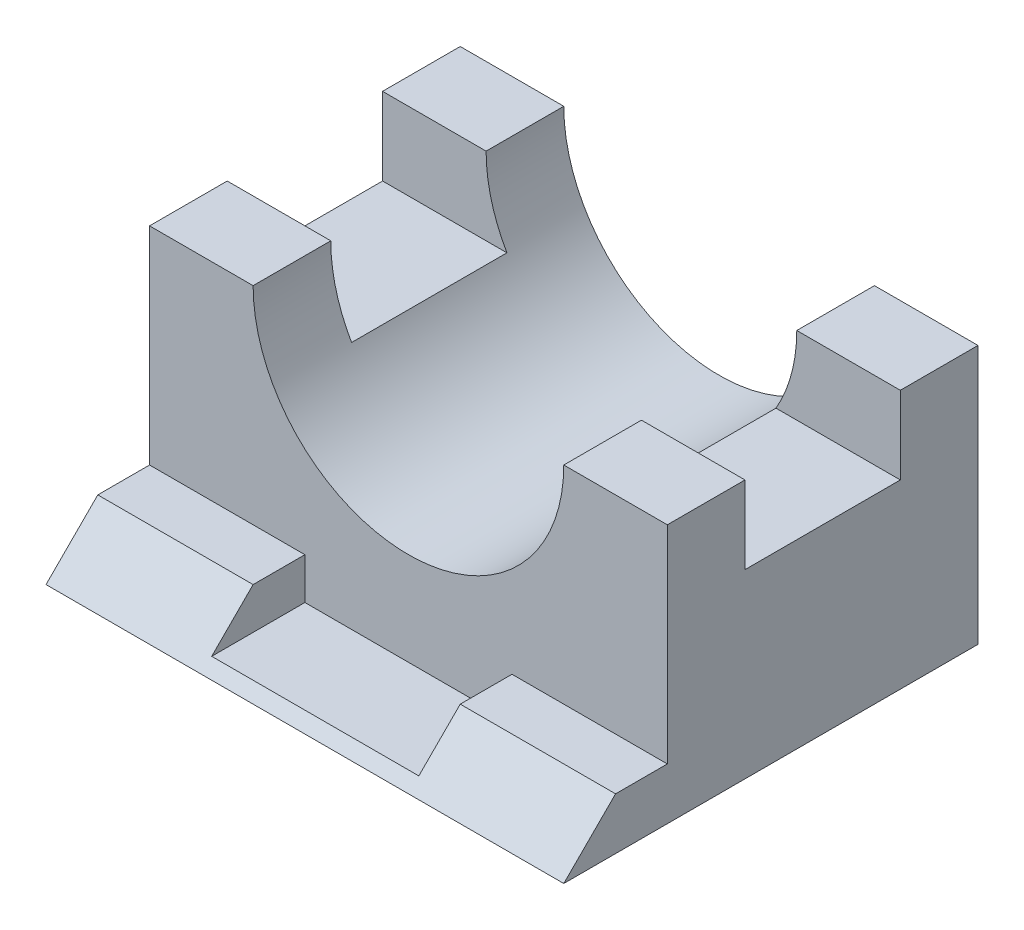
ISO-10303-21;
HEADER;
FILE_DESCRIPTION(('STEP AP214'),'2;1');
FILE_NAME('part.step','',(''),(''),'','','');
FILE_SCHEMA(('AUTOMOTIVE_DESIGN { 1 0 10303 214 1 1 1 1 }'));
ENDSEC;
DATA;
#1=APPLICATION_CONTEXT('core data for automotive mechanical design processes');
#2=APPLICATION_PROTOCOL_DEFINITION('international standard','automotive_design',2000,#1);
#3=PRODUCT_CONTEXT('',#1,'mechanical');
#4=PRODUCT('Part','Part','',(#3));
#5=PRODUCT_RELATED_PRODUCT_CATEGORY('part','',(#4));
#6=PRODUCT_DEFINITION_FORMATION('','',#4);
#7=PRODUCT_DEFINITION_CONTEXT('part definition',#1,'design');
#8=PRODUCT_DEFINITION('design','',#6,#7);
#9=PRODUCT_DEFINITION_SHAPE('','',#8);
#10=(LENGTH_UNIT() NAMED_UNIT(*) SI_UNIT(.MILLI.,.METRE.));
#11=(NAMED_UNIT(*) PLANE_ANGLE_UNIT() SI_UNIT($,.RADIAN.));
#12=(NAMED_UNIT(*) SI_UNIT($,.STERADIAN.) SOLID_ANGLE_UNIT());
#13=UNCERTAINTY_MEASURE_WITH_UNIT(LENGTH_MEASURE(1.E-05),#10,'distance_accuracy_value','');
#14=(GEOMETRIC_REPRESENTATION_CONTEXT(3) GLOBAL_UNCERTAINTY_ASSIGNED_CONTEXT((#13)) GLOBAL_UNIT_ASSIGNED_CONTEXT((#10,
#11,#12)) REPRESENTATION_CONTEXT('',''));
#15=CARTESIAN_POINT('',(0.,0.,0.));
#16=DIRECTION('',(0.,0.,1.));
#17=DIRECTION('',(1.,0.,0.));
#18=AXIS2_PLACEMENT_3D('',#15,#16,#17);
#19=CARTESIAN_POINT('',(50.,10.,20.));
#20=DIRECTION('',(0.,-1.,0.));
#21=DIRECTION('',(0.,0.,-1.));
#22=AXIS2_PLACEMENT_3D('',#19,#20,#21);
#23=PLANE('',#22);
#24=DIRECTION('',(0.,0.,-1.));
#25=VECTOR('',#24,1.);
#26=CARTESIAN_POINT('',(-20.,10.,120.));
#27=LINE('',#26,#25);
#28=CARTESIAN_POINT('',(-20.,10.,30.));
#29=VERTEX_POINT('',#28);
#30=CARTESIAN_POINT('',(-20.,10.,20.));
#31=VERTEX_POINT('',#30);
#32=EDGE_CURVE('E194',#29,#31,#27,.T.);
#33=ORIENTED_EDGE('',*,*,#32,.T.);
#34=DIRECTION('',(-1.,0.,0.));
#35=VECTOR('',#34,1.);
#36=CARTESIAN_POINT('',(50.,10.,20.));
#37=LINE('',#36,#35);
#38=CARTESIAN_POINT('',(-50.,10.,20.));
#39=VERTEX_POINT('',#38);
#40=EDGE_CURVE('E190',#31,#39,#37,.T.);
#41=ORIENTED_EDGE('',*,*,#40,.T.);
#42=DIRECTION('',(0.,0.,1.));
#43=VECTOR('',#42,1.);
#44=CARTESIAN_POINT('',(-50.,10.,20.));
#45=LINE('',#44,#43);
#46=CARTESIAN_POINT('',(-50.,10.,30.));
#47=VERTEX_POINT('',#46);
#48=EDGE_CURVE('E260',#39,#47,#45,.T.);
#49=ORIENTED_EDGE('',*,*,#48,.T.);
#50=DIRECTION('',(-1.,0.,0.));
#51=VECTOR('',#50,1.);
#52=CARTESIAN_POINT('',(50.,10.,30.));
#53=LINE('',#52,#51);
#54=EDGE_CURVE('E278',#29,#47,#53,.T.);
#55=ORIENTED_EDGE('',*,*,#54,.F.);
#56=EDGE_LOOP('',(#33,#41,#49,#55));
#57=FACE_BOUND('',#56,.T.);
#58=ADVANCED_FACE('F33',(#57),#23,.F.);
#59=DIRECTION('',(0.,0.,-1.));
#60=VECTOR('',#59,1.);
#61=CARTESIAN_POINT('',(20.,10.,120.));
#62=LINE('',#61,#60);
#63=CARTESIAN_POINT('',(20.,10.,30.));
#64=VERTEX_POINT('',#63);
#65=CARTESIAN_POINT('',(20.,10.,20.));
#66=VERTEX_POINT('',#65);
#67=EDGE_CURVE('E196',#64,#66,#62,.T.);
#68=ORIENTED_EDGE('',*,*,#67,.F.);
#69=CARTESIAN_POINT('',(50.,10.,30.));
#70=VERTEX_POINT('',#69);
#71=EDGE_CURVE('E279',#70,#64,#53,.T.);
#72=ORIENTED_EDGE('',*,*,#71,.F.);
#73=DIRECTION('',(0.,0.,1.));
#74=VECTOR('',#73,1.);
#75=CARTESIAN_POINT('',(50.,10.,20.));
#76=LINE('',#75,#74);
#77=CARTESIAN_POINT('',(50.,10.,20.));
#78=VERTEX_POINT('',#77);
#79=EDGE_CURVE('E234',#78,#70,#76,.T.);
#80=ORIENTED_EDGE('',*,*,#79,.F.);
#81=EDGE_CURVE('E282',#78,#66,#37,.T.);
#82=ORIENTED_EDGE('',*,*,#81,.T.);
#83=EDGE_LOOP('',(#68,#72,#80,#82));
#84=FACE_BOUND('',#83,.T.);
#85=ADVANCED_FACE('F315',(#84),#23,.F.);
#86=CARTESIAN_POINT('',(50.,10.,30.));
#87=DIRECTION('',(0.,-0.707106781186547,-0.707106781186548));
#88=DIRECTION('',(0.,0.707106781186548,-0.707106781186547));
#89=AXIS2_PLACEMENT_3D('',#86,#87,#88);
#90=PLANE('',#89);
#91=DIRECTION('',(0.,-0.707106781186548,0.707106781186547));
#92=VECTOR('',#91,1.);
#93=CARTESIAN_POINT('',(-20.,9.99999999999998,30.));
#94=LINE('',#93,#92);
#95=CARTESIAN_POINT('',(-20.,2.,38.));
#96=VERTEX_POINT('',#95);
#97=EDGE_CURVE('E11',#29,#96,#94,.T.);
#98=ORIENTED_EDGE('',*,*,#97,.F.);
#99=ORIENTED_EDGE('',*,*,#54,.T.);
#100=DIRECTION('',(0.,-0.707106781186548,0.707106781186547));
#101=VECTOR('',#100,1.);
#102=CARTESIAN_POINT('',(-50.,10.,30.));
#103=LINE('',#102,#101);
#104=CARTESIAN_POINT('',(-50.,0.,40.));
#105=VERTEX_POINT('',#104);
#106=EDGE_CURVE('E263',#47,#105,#103,.T.);
#107=ORIENTED_EDGE('',*,*,#106,.T.);
#108=DIRECTION('',(-1.,0.,0.));
#109=VECTOR('',#108,1.);
#110=CARTESIAN_POINT('',(50.,0.,40.));
#111=LINE('',#110,#109);
#112=CARTESIAN_POINT('',(50.,0.,40.));
#113=VERTEX_POINT('',#112);
#114=EDGE_CURVE('E275',#113,#105,#111,.T.);
#115=ORIENTED_EDGE('',*,*,#114,.F.);
#116=DIRECTION('',(0.,-0.707106781186548,0.707106781186547));
#117=VECTOR('',#116,1.);
#118=CARTESIAN_POINT('',(50.,10.,30.));
#119=LINE('',#118,#117);
#120=EDGE_CURVE('E236',#70,#113,#119,.T.);
#121=ORIENTED_EDGE('',*,*,#120,.F.);
#122=ORIENTED_EDGE('',*,*,#71,.T.);
#123=DIRECTION('',(0.,0.707106781186548,-0.707106781186547));
#124=VECTOR('',#123,1.);
#125=CARTESIAN_POINT('',(20.,10.,30.));
#126=LINE('',#125,#124);
#127=CARTESIAN_POINT('',(20.,2.,38.));
#128=VERTEX_POINT('',#127);
#129=EDGE_CURVE('E306',#128,#64,#126,.T.);
#130=ORIENTED_EDGE('',*,*,#129,.F.);
#131=DIRECTION('',(1.,0.,0.));
#132=VECTOR('',#131,1.);
#133=CARTESIAN_POINT('',(50.,2.,38.));
#134=LINE('',#133,#132);
#135=EDGE_CURVE('E41',#96,#128,#134,.T.);
#136=ORIENTED_EDGE('',*,*,#135,.F.);
#137=EDGE_LOOP('',(#98,#99,#107,#115,#121,#122,#130,#136));
#138=FACE_BOUND('',#137,.T.);
#139=ADVANCED_FACE('F309',(#138),#90,.F.);
#140=CARTESIAN_POINT('',(50.,50.,-40.));
#141=DIRECTION('',(0.,-1.,0.));
#142=DIRECTION('',(0.,0.,-1.));
#143=AXIS2_PLACEMENT_3D('',#140,#141,#142);
#144=PLANE('',#143);
#145=DIRECTION('',(-1.,0.,0.));
#146=VECTOR('',#145,1.);
#147=CARTESIAN_POINT('',(50.,50.,-40.));
#148=LINE('',#147,#146);
#149=CARTESIAN_POINT('',(50.,50.,-40.));
#150=VERTEX_POINT('',#149);
#151=CARTESIAN_POINT('',(30.,50.,-40.));
#152=VERTEX_POINT('',#151);
#153=EDGE_CURVE('E269',#150,#152,#148,.T.);
#154=ORIENTED_EDGE('',*,*,#153,.T.);
#155=DIRECTION('',(0.,0.,1.));
#156=VECTOR('',#155,1.);
#157=CARTESIAN_POINT('',(30.,50.,-80.));
#158=LINE('',#157,#156);
#159=CARTESIAN_POINT('',(30.,50.,-25.));
#160=VERTEX_POINT('',#159);
#161=EDGE_CURVE('E56',#152,#160,#158,.T.);
#162=ORIENTED_EDGE('',*,*,#161,.T.);
#163=DIRECTION('',(-1.,0.,0.));
#164=VECTOR('',#163,1.);
#165=CARTESIAN_POINT('',(50.,50.,-25.));
#166=LINE('',#165,#164);
#167=CARTESIAN_POINT('',(50.,50.,-25.));
#168=VERTEX_POINT('',#167);
#169=EDGE_CURVE('E301',#168,#160,#166,.T.);
#170=ORIENTED_EDGE('',*,*,#169,.F.);
#171=DIRECTION('',(0.,0.,1.));
#172=VECTOR('',#171,1.);
#173=CARTESIAN_POINT('',(50.,50.,-40.));
#174=LINE('',#173,#172);
#175=EDGE_CURVE('E220',#150,#168,#174,.T.);
#176=ORIENTED_EDGE('',*,*,#175,.F.);
#177=EDGE_LOOP('',(#154,#162,#170,#176));
#178=FACE_BOUND('',#177,.T.);
#179=ADVANCED_FACE('F343',(#178),#144,.F.);
#180=CARTESIAN_POINT('',(50.,50.,-25.));
#181=DIRECTION('',(0.,0.,-1.));
#182=DIRECTION('',(0.,1.,0.));
#183=AXIS2_PLACEMENT_3D('',#180,#181,#182);
#184=PLANE('',#183);
#185=ORIENTED_EDGE('',*,*,#169,.T.);
#186=CARTESIAN_POINT('',(0.,50.,-25.));
#187=DIRECTION('',(0.,0.,-1.));
#188=DIRECTION('',(0.,1.,0.));
#189=AXIS2_PLACEMENT_3D('',#186,#187,#188);
#190=CIRCLE('',#189,30.);
#191=CARTESIAN_POINT('',(25.9807621135332,35.,-25.));
#192=VERTEX_POINT('',#191);
#193=EDGE_CURVE('E216',#160,#192,#190,.T.);
#194=ORIENTED_EDGE('',*,*,#193,.T.);
#195=DIRECTION('',(-1.,0.,0.));
#196=VECTOR('',#195,1.);
#197=CARTESIAN_POINT('',(50.,35.,-25.));
#198=LINE('',#197,#196);
#199=CARTESIAN_POINT('',(50.,35.,-25.));
#200=VERTEX_POINT('',#199);
#201=EDGE_CURVE('E297',#200,#192,#198,.T.);
#202=ORIENTED_EDGE('',*,*,#201,.F.);
#203=DIRECTION('',(0.,-1.,0.));
#204=VECTOR('',#203,1.);
#205=CARTESIAN_POINT('',(50.,50.,-25.));
#206=LINE('',#205,#204);
#207=EDGE_CURVE('E223',#168,#200,#206,.T.);
#208=ORIENTED_EDGE('',*,*,#207,.F.);
#209=EDGE_LOOP('',(#185,#194,#202,#208));
#210=FACE_BOUND('',#209,.T.);
#211=ADVANCED_FACE('F339',(#210),#184,.F.);
#212=CARTESIAN_POINT('',(50.,35.,-25.));
#213=DIRECTION('',(0.,-1.,0.));
#214=DIRECTION('',(0.,0.,-1.));
#215=AXIS2_PLACEMENT_3D('',#212,#213,#214);
#216=PLANE('',#215);
#217=ORIENTED_EDGE('',*,*,#201,.T.);
#218=DIRECTION('',(0.,0.,1.));
#219=VECTOR('',#218,1.);
#220=CARTESIAN_POINT('',(25.9807621135332,35.,-80.));
#221=LINE('',#220,#219);
#222=CARTESIAN_POINT('',(25.9807621135332,35.,4.99999999999999));
#223=VERTEX_POINT('',#222);
#224=EDGE_CURVE('E217',#192,#223,#221,.T.);
#225=ORIENTED_EDGE('',*,*,#224,.T.);
#226=DIRECTION('',(-1.,0.,0.));
#227=VECTOR('',#226,1.);
#228=CARTESIAN_POINT('',(50.,35.,4.99999999999999));
#229=LINE('',#228,#227);
#230=CARTESIAN_POINT('',(50.,35.,4.99999999999999));
#231=VERTEX_POINT('',#230);
#232=EDGE_CURVE('E293',#231,#223,#229,.T.);
#233=ORIENTED_EDGE('',*,*,#232,.F.);
#234=DIRECTION('',(0.,0.,1.));
#235=VECTOR('',#234,1.);
#236=CARTESIAN_POINT('',(50.,35.,-25.));
#237=LINE('',#236,#235);
#238=EDGE_CURVE('E226',#200,#231,#237,.T.);
#239=ORIENTED_EDGE('',*,*,#238,.F.);
#240=EDGE_LOOP('',(#217,#225,#233,#239));
#241=FACE_BOUND('',#240,.T.);
#242=ADVANCED_FACE('F335',(#241),#216,.F.);
#243=CARTESIAN_POINT('',(50.,35.,4.99999999999999));
#244=DIRECTION('',(0.,0.,1.));
#245=DIRECTION('',(0.,-1.,0.));
#246=AXIS2_PLACEMENT_3D('',#243,#244,#245);
#247=PLANE('',#246);
#248=ORIENTED_EDGE('',*,*,#232,.T.);
#249=CARTESIAN_POINT('',(0.,50.,4.99999999999999));
#250=DIRECTION('',(0.,0.,1.));
#251=DIRECTION('',(0.,-1.,0.));
#252=AXIS2_PLACEMENT_3D('',#249,#250,#251);
#253=CIRCLE('',#252,30.);
#254=CARTESIAN_POINT('',(30.,50.,4.99999999999999));
#255=VERTEX_POINT('',#254);
#256=EDGE_CURVE('E210',#223,#255,#253,.T.);
#257=ORIENTED_EDGE('',*,*,#256,.T.);
#258=DIRECTION('',(-1.,0.,0.));
#259=VECTOR('',#258,1.);
#260=CARTESIAN_POINT('',(50.,50.,4.99999999999999));
#261=LINE('',#260,#259);
#262=CARTESIAN_POINT('',(50.,50.,4.99999999999999));
#263=VERTEX_POINT('',#262);
#264=EDGE_CURVE('E289',#263,#255,#261,.T.);
#265=ORIENTED_EDGE('',*,*,#264,.F.);
#266=DIRECTION('',(0.,1.,0.));
#267=VECTOR('',#266,1.);
#268=CARTESIAN_POINT('',(50.,35.,4.99999999999999));
#269=LINE('',#268,#267);
#270=EDGE_CURVE('E228',#231,#263,#269,.T.);
#271=ORIENTED_EDGE('',*,*,#270,.F.);
#272=EDGE_LOOP('',(#248,#257,#265,#271));
#273=FACE_BOUND('',#272,.T.);
#274=ADVANCED_FACE('F331',(#273),#247,.F.);
#275=CARTESIAN_POINT('',(50.,50.,4.99999999999999));
#276=DIRECTION('',(0.,-1.,0.));
#277=DIRECTION('',(0.,0.,-1.));
#278=AXIS2_PLACEMENT_3D('',#275,#276,#277);
#279=PLANE('',#278);
#280=ORIENTED_EDGE('',*,*,#264,.T.);
#281=CARTESIAN_POINT('',(30.,50.,20.));
#282=VERTEX_POINT('',#281);
#283=EDGE_CURVE('E201',#255,#282,#158,.T.);
#284=ORIENTED_EDGE('',*,*,#283,.T.);
#285=DIRECTION('',(-1.,0.,0.));
#286=VECTOR('',#285,1.);
#287=CARTESIAN_POINT('',(50.,50.,20.));
#288=LINE('',#287,#286);
#289=CARTESIAN_POINT('',(50.,50.,20.));
#290=VERTEX_POINT('',#289);
#291=EDGE_CURVE('E286',#290,#282,#288,.T.);
#292=ORIENTED_EDGE('',*,*,#291,.F.);
#293=DIRECTION('',(0.,0.,1.));
#294=VECTOR('',#293,1.);
#295=CARTESIAN_POINT('',(50.,50.,4.99999999999999));
#296=LINE('',#295,#294);
#297=EDGE_CURVE('E230',#263,#290,#296,.T.);
#298=ORIENTED_EDGE('',*,*,#297,.F.);
#299=EDGE_LOOP('',(#280,#284,#292,#298));
#300=FACE_BOUND('',#299,.T.);
#301=ADVANCED_FACE('F327',(#300),#279,.F.);
#302=CARTESIAN_POINT('',(-30.,50.,-25.));
#303=VERTEX_POINT('',#302);
#304=CARTESIAN_POINT('',(-50.,50.,-25.));
#305=VERTEX_POINT('',#304);
#306=EDGE_CURVE('E300',#303,#305,#166,.T.);
#307=ORIENTED_EDGE('',*,*,#306,.F.);
#308=DIRECTION('',(0.,0.,1.));
#309=VECTOR('',#308,1.);
#310=CARTESIAN_POINT('',(-30.,50.,-80.));
#311=LINE('',#310,#309);
#312=CARTESIAN_POINT('',(-30.,50.,-40.));
#313=VERTEX_POINT('',#312);
#314=EDGE_CURVE('E204',#313,#303,#311,.T.);
#315=ORIENTED_EDGE('',*,*,#314,.F.);
#316=CARTESIAN_POINT('',(-50.,50.,-40.));
#317=VERTEX_POINT('',#316);
#318=EDGE_CURVE('E242',#313,#317,#148,.T.);
#319=ORIENTED_EDGE('',*,*,#318,.T.);
#320=DIRECTION('',(0.,0.,1.));
#321=VECTOR('',#320,1.);
#322=CARTESIAN_POINT('',(-50.,50.,-40.));
#323=LINE('',#322,#321);
#324=EDGE_CURVE('E243',#317,#305,#323,.T.);
#325=ORIENTED_EDGE('',*,*,#324,.T.);
#326=EDGE_LOOP('',(#307,#315,#319,#325));
#327=FACE_BOUND('',#326,.T.);
#328=ADVANCED_FACE('F35',(#327),#144,.F.);
#329=CARTESIAN_POINT('',(-25.9807621135332,35.,-25.));
#330=VERTEX_POINT('',#329);
#331=CARTESIAN_POINT('',(-50.,35.,-25.));
#332=VERTEX_POINT('',#331);
#333=EDGE_CURVE('E296',#330,#332,#198,.T.);
#334=ORIENTED_EDGE('',*,*,#333,.F.);
#335=EDGE_CURVE('E213',#330,#303,#190,.T.);
#336=ORIENTED_EDGE('',*,*,#335,.T.);
#337=ORIENTED_EDGE('',*,*,#306,.T.);
#338=DIRECTION('',(0.,-1.,0.));
#339=VECTOR('',#338,1.);
#340=CARTESIAN_POINT('',(-50.,50.,-25.));
#341=LINE('',#340,#339);
#342=EDGE_CURVE('E246',#305,#332,#341,.T.);
#343=ORIENTED_EDGE('',*,*,#342,.T.);
#344=EDGE_LOOP('',(#334,#336,#337,#343));
#345=FACE_BOUND('',#344,.T.);
#346=ADVANCED_FACE('F356',(#345),#184,.F.);
#347=CARTESIAN_POINT('',(-25.9807621135332,35.,4.99999999999999));
#348=VERTEX_POINT('',#347);
#349=CARTESIAN_POINT('',(-50.,35.,4.99999999999999));
#350=VERTEX_POINT('',#349);
#351=EDGE_CURVE('E292',#348,#350,#229,.T.);
#352=ORIENTED_EDGE('',*,*,#351,.F.);
#353=DIRECTION('',(0.,0.,1.));
#354=VECTOR('',#353,1.);
#355=CARTESIAN_POINT('',(-25.9807621135332,35.,-80.));
#356=LINE('',#355,#354);
#357=EDGE_CURVE('E209',#348,#330,#356,.F.);
#358=ORIENTED_EDGE('',*,*,#357,.T.);
#359=ORIENTED_EDGE('',*,*,#333,.T.);
#360=DIRECTION('',(0.,0.,1.));
#361=VECTOR('',#360,1.);
#362=CARTESIAN_POINT('',(-50.,35.,-25.));
#363=LINE('',#362,#361);
#364=EDGE_CURVE('E249',#332,#350,#363,.T.);
#365=ORIENTED_EDGE('',*,*,#364,.T.);
#366=EDGE_LOOP('',(#352,#358,#359,#365));
#367=FACE_BOUND('',#366,.T.);
#368=ADVANCED_FACE('F365',(#367),#216,.F.);
#369=CARTESIAN_POINT('',(-30.,50.,4.99999999999999));
#370=VERTEX_POINT('',#369);
#371=CARTESIAN_POINT('',(-50.,50.,4.99999999999999));
#372=VERTEX_POINT('',#371);
#373=EDGE_CURVE('E288',#370,#372,#261,.T.);
#374=ORIENTED_EDGE('',*,*,#373,.F.);
#375=EDGE_CURVE('E206',#370,#348,#253,.T.);
#376=ORIENTED_EDGE('',*,*,#375,.T.);
#377=ORIENTED_EDGE('',*,*,#351,.T.);
#378=DIRECTION('',(0.,1.,0.));
#379=VECTOR('',#378,1.);
#380=CARTESIAN_POINT('',(-50.,35.,4.99999999999999));
#381=LINE('',#380,#379);
#382=EDGE_CURVE('E252',#350,#372,#381,.T.);
#383=ORIENTED_EDGE('',*,*,#382,.T.);
#384=EDGE_LOOP('',(#374,#376,#377,#383));
#385=FACE_BOUND('',#384,.T.);
#386=ADVANCED_FACE('F369',(#385),#247,.F.);
#387=CARTESIAN_POINT('',(-30.,50.,20.));
#388=VERTEX_POINT('',#387);
#389=CARTESIAN_POINT('',(-50.,50.,20.));
#390=VERTEX_POINT('',#389);
#391=EDGE_CURVE('E285',#388,#390,#288,.T.);
#392=ORIENTED_EDGE('',*,*,#391,.F.);
#393=EDGE_CURVE('E200',#370,#388,#311,.T.);
#394=ORIENTED_EDGE('',*,*,#393,.F.);
#395=ORIENTED_EDGE('',*,*,#373,.T.);
#396=DIRECTION('',(0.,0.,1.));
#397=VECTOR('',#396,1.);
#398=CARTESIAN_POINT('',(-50.,50.,4.99999999999999));
#399=LINE('',#398,#397);
#400=EDGE_CURVE('E255',#372,#390,#399,.T.);
#401=ORIENTED_EDGE('',*,*,#400,.T.);
#402=EDGE_LOOP('',(#392,#394,#395,#401));
#403=FACE_BOUND('',#402,.T.);
#404=ADVANCED_FACE('F372',(#403),#279,.F.);
#405=CARTESIAN_POINT('',(50.,50.,20.));
#406=DIRECTION('',(0.,0.,-1.));
#407=DIRECTION('',(0.,1.,0.));
#408=AXIS2_PLACEMENT_3D('',#405,#406,#407);
#409=PLANE('',#408);
#410=ORIENTED_EDGE('',*,*,#291,.T.);
#411=CARTESIAN_POINT('',(0.,50.,20.));
#412=DIRECTION('',(0.,0.,1.));
#413=DIRECTION('',(1.,0.,0.));
#414=AXIS2_PLACEMENT_3D('',#411,#412,#413);
#415=CIRCLE('',#414,30.);
#416=EDGE_CURVE('E177',#388,#282,#415,.T.);
#417=ORIENTED_EDGE('',*,*,#416,.F.);
#418=ORIENTED_EDGE('',*,*,#391,.T.);
#419=DIRECTION('',(0.,-1.,0.));
#420=VECTOR('',#419,1.);
#421=CARTESIAN_POINT('',(-50.,50.,20.));
#422=LINE('',#421,#420);
#423=EDGE_CURVE('E258',#390,#39,#422,.T.);
#424=ORIENTED_EDGE('',*,*,#423,.T.);
#425=ORIENTED_EDGE('',*,*,#40,.F.);
#426=DIRECTION('',(0.,-1.,0.));
#427=VECTOR('',#426,1.);
#428=CARTESIAN_POINT('',(-20.,10.,20.));
#429=LINE('',#428,#427);
#430=CARTESIAN_POINT('',(-20.,2.,20.));
#431=VERTEX_POINT('',#430);
#432=EDGE_CURVE('E172',#31,#431,#429,.T.);
#433=ORIENTED_EDGE('',*,*,#432,.T.);
#434=DIRECTION('',(1.,0.,0.));
#435=VECTOR('',#434,1.);
#436=CARTESIAN_POINT('',(-20.,2.,20.));
#437=LINE('',#436,#435);
#438=CARTESIAN_POINT('',(20.,2.,20.));
#439=VERTEX_POINT('',#438);
#440=EDGE_CURVE('E180',#431,#439,#437,.T.);
#441=ORIENTED_EDGE('',*,*,#440,.T.);
#442=DIRECTION('',(0.,1.,0.));
#443=VECTOR('',#442,1.);
#444=CARTESIAN_POINT('',(20.,10.,20.));
#445=LINE('',#444,#443);
#446=EDGE_CURVE('E184',#439,#66,#445,.T.);
#447=ORIENTED_EDGE('',*,*,#446,.T.);
#448=ORIENTED_EDGE('',*,*,#81,.F.);
#449=DIRECTION('',(0.,-1.,0.));
#450=VECTOR('',#449,1.);
#451=CARTESIAN_POINT('',(50.,50.,20.));
#452=LINE('',#451,#450);
#453=EDGE_CURVE('E232',#290,#78,#452,.T.);
#454=ORIENTED_EDGE('',*,*,#453,.F.);
#455=EDGE_LOOP('',(#410,#417,#418,#424,#425,#433,#441,#447,#448,#454));
#456=FACE_BOUND('',#455,.T.);
#457=ADVANCED_FACE('F188',(#456),#409,.F.);
#458=CARTESIAN_POINT('',(50.,0.,40.));
#459=DIRECTION('',(0.,1.,0.));
#460=DIRECTION('',(0.,0.,1.));
#461=AXIS2_PLACEMENT_3D('',#458,#459,#460);
#462=PLANE('',#461);
#463=DIRECTION('',(0.,0.,-1.));
#464=VECTOR('',#463,1.);
#465=CARTESIAN_POINT('',(-50.,0.,40.));
#466=LINE('',#465,#464);
#467=CARTESIAN_POINT('',(-50.,0.,-40.));
#468=VERTEX_POINT('',#467);
#469=EDGE_CURVE('E265',#105,#468,#466,.T.);
#470=ORIENTED_EDGE('',*,*,#469,.T.);
#471=DIRECTION('',(-1.,0.,0.));
#472=VECTOR('',#471,1.);
#473=CARTESIAN_POINT('',(50.,0.,-40.));
#474=LINE('',#473,#472);
#475=CARTESIAN_POINT('',(50.,0.,-40.));
#476=VERTEX_POINT('',#475);
#477=EDGE_CURVE('E272',#476,#468,#474,.T.);
#478=ORIENTED_EDGE('',*,*,#477,.F.);
#479=DIRECTION('',(0.,0.,-1.));
#480=VECTOR('',#479,1.);
#481=CARTESIAN_POINT('',(50.,0.,40.));
#482=LINE('',#481,#480);
#483=EDGE_CURVE('E238',#113,#476,#482,.T.);
#484=ORIENTED_EDGE('',*,*,#483,.F.);
#485=ORIENTED_EDGE('',*,*,#114,.T.);
#486=EDGE_LOOP('',(#470,#478,#484,#485));
#487=FACE_BOUND('',#486,.T.);
#488=ADVANCED_FACE('F382',(#487),#462,.F.);
#489=CARTESIAN_POINT('',(50.,0.,-40.));
#490=DIRECTION('',(0.,0.,1.));
#491=DIRECTION('',(1.,0.,0.));
#492=AXIS2_PLACEMENT_3D('',#489,#490,#491);
#493=PLANE('',#492);
#494=ORIENTED_EDGE('',*,*,#318,.F.);
#495=CARTESIAN_POINT('',(0.,50.,-40.));
#496=DIRECTION('',(0.,0.,1.));
#497=DIRECTION('',(1.,0.,0.));
#498=AXIS2_PLACEMENT_3D('',#495,#496,#497);
#499=CIRCLE('',#498,30.);
#500=EDGE_CURVE('E304',#313,#152,#499,.T.);
#501=ORIENTED_EDGE('',*,*,#500,.T.);
#502=ORIENTED_EDGE('',*,*,#153,.F.);
#503=DIRECTION('',(0.,1.,0.));
#504=VECTOR('',#503,1.);
#505=CARTESIAN_POINT('',(50.,0.,-40.));
#506=LINE('',#505,#504);
#507=EDGE_CURVE('E240',#476,#150,#506,.T.);
#508=ORIENTED_EDGE('',*,*,#507,.F.);
#509=ORIENTED_EDGE('',*,*,#477,.T.);
#510=DIRECTION('',(0.,1.,0.));
#511=VECTOR('',#510,1.);
#512=CARTESIAN_POINT('',(-50.,0.,-40.));
#513=LINE('',#512,#511);
#514=EDGE_CURVE('E224',#468,#317,#513,.T.);
#515=ORIENTED_EDGE('',*,*,#514,.T.);
#516=EDGE_LOOP('',(#494,#501,#502,#508,#509,#515));
#517=FACE_BOUND('',#516,.T.);
#518=ADVANCED_FACE('F348',(#517),#493,.F.);
#519=CARTESIAN_POINT('',(50.,0.,0.));
#520=DIRECTION('',(1.,0.,0.));
#521=DIRECTION('',(0.,0.,-1.));
#522=AXIS2_PLACEMENT_3D('',#519,#520,#521);
#523=PLANE('',#522);
#524=ORIENTED_EDGE('',*,*,#175,.T.);
#525=ORIENTED_EDGE('',*,*,#207,.T.);
#526=ORIENTED_EDGE('',*,*,#238,.T.);
#527=ORIENTED_EDGE('',*,*,#270,.T.);
#528=ORIENTED_EDGE('',*,*,#297,.T.);
#529=ORIENTED_EDGE('',*,*,#453,.T.);
#530=ORIENTED_EDGE('',*,*,#79,.T.);
#531=ORIENTED_EDGE('',*,*,#120,.T.);
#532=ORIENTED_EDGE('',*,*,#483,.T.);
#533=ORIENTED_EDGE('',*,*,#507,.T.);
#534=EDGE_LOOP('',(#524,#525,#526,#527,#528,#529,#530,#531,#532,#533));
#535=FACE_BOUND('',#534,.T.);
#536=ADVANCED_FACE('F322',(#535),#523,.T.);
#537=CARTESIAN_POINT('',(-50.,0.,0.));
#538=DIRECTION('',(1.,0.,0.));
#539=DIRECTION('',(0.,0.,-1.));
#540=AXIS2_PLACEMENT_3D('',#537,#538,#539);
#541=PLANE('',#540);
#542=ORIENTED_EDGE('',*,*,#324,.F.);
#543=ORIENTED_EDGE('',*,*,#514,.F.);
#544=ORIENTED_EDGE('',*,*,#469,.F.);
#545=ORIENTED_EDGE('',*,*,#106,.F.);
#546=ORIENTED_EDGE('',*,*,#48,.F.);
#547=ORIENTED_EDGE('',*,*,#423,.F.);
#548=ORIENTED_EDGE('',*,*,#400,.F.);
#549=ORIENTED_EDGE('',*,*,#382,.F.);
#550=ORIENTED_EDGE('',*,*,#364,.F.);
#551=ORIENTED_EDGE('',*,*,#342,.F.);
#552=EDGE_LOOP('',(#542,#543,#544,#545,#546,#547,#548,#549,#550,#551));
#553=FACE_BOUND('',#552,.T.);
#554=ADVANCED_FACE('F359',(#553),#541,.F.);
#555=CARTESIAN_POINT('',(0.,50.,-80.));
#556=DIRECTION('',(0.,0.,1.));
#557=DIRECTION('',(1.,0.,0.));
#558=AXIS2_PLACEMENT_3D('',#555,#556,#557);
#559=CYLINDRICAL_SURFACE('',#558,30.);
#560=ORIENTED_EDGE('',*,*,#161,.F.);
#561=ORIENTED_EDGE('',*,*,#500,.F.);
#562=ORIENTED_EDGE('',*,*,#314,.T.);
#563=ORIENTED_EDGE('',*,*,#335,.F.);
#564=ORIENTED_EDGE('',*,*,#357,.F.);
#565=ORIENTED_EDGE('',*,*,#375,.F.);
#566=ORIENTED_EDGE('',*,*,#393,.T.);
#567=ORIENTED_EDGE('',*,*,#416,.T.);
#568=ORIENTED_EDGE('',*,*,#283,.F.);
#569=ORIENTED_EDGE('',*,*,#256,.F.);
#570=ORIENTED_EDGE('',*,*,#224,.F.);
#571=ORIENTED_EDGE('',*,*,#193,.F.);
#572=EDGE_LOOP('',(#560,#561,#562,#563,#564,#565,#566,#567,#568,#569,#570,#571));
#573=FACE_BOUND('',#572,.T.);
#574=ADVANCED_FACE('F329',(#573),#559,.F.);
#575=CARTESIAN_POINT('',(-20.,10.,120.));
#576=DIRECTION('',(1.,0.,0.));
#577=DIRECTION('',(0.,1.,0.));
#578=AXIS2_PLACEMENT_3D('',#575,#576,#577);
#579=PLANE('',#578);
#580=ORIENTED_EDGE('',*,*,#97,.T.);
#581=DIRECTION('',(0.,0.,-1.));
#582=VECTOR('',#581,1.);
#583=CARTESIAN_POINT('',(-20.,2.,120.));
#584=LINE('',#583,#582);
#585=EDGE_CURVE('E168',#96,#431,#584,.T.);
#586=ORIENTED_EDGE('',*,*,#585,.T.);
#587=ORIENTED_EDGE('',*,*,#432,.F.);
#588=ORIENTED_EDGE('',*,*,#32,.F.);
#589=EDGE_LOOP('',(#580,#586,#587,#588));
#590=FACE_BOUND('',#589,.T.);
#591=ADVANCED_FACE('F170',(#590),#579,.T.);
#592=CARTESIAN_POINT('',(-20.,2.,120.));
#593=DIRECTION('',(0.,1.,0.));
#594=DIRECTION('',(0.,0.,1.));
#595=AXIS2_PLACEMENT_3D('',#592,#593,#594);
#596=PLANE('',#595);
#597=ORIENTED_EDGE('',*,*,#135,.T.);
#598=DIRECTION('',(0.,0.,-1.));
#599=VECTOR('',#598,1.);
#600=CARTESIAN_POINT('',(20.,2.,120.));
#601=LINE('',#600,#599);
#602=EDGE_CURVE('E48',#128,#439,#601,.T.);
#603=ORIENTED_EDGE('',*,*,#602,.T.);
#604=ORIENTED_EDGE('',*,*,#440,.F.);
#605=ORIENTED_EDGE('',*,*,#585,.F.);
#606=EDGE_LOOP('',(#597,#603,#604,#605));
#607=FACE_BOUND('',#606,.T.);
#608=ADVANCED_FACE('F181',(#607),#596,.T.);
#609=CARTESIAN_POINT('',(20.,10.,120.));
#610=DIRECTION('',(-1.,0.,0.));
#611=DIRECTION('',(0.,0.,1.));
#612=AXIS2_PLACEMENT_3D('',#609,#610,#611);
#613=PLANE('',#612);
#614=ORIENTED_EDGE('',*,*,#129,.T.);
#615=ORIENTED_EDGE('',*,*,#67,.T.);
#616=ORIENTED_EDGE('',*,*,#446,.F.);
#617=ORIENTED_EDGE('',*,*,#602,.F.);
#618=EDGE_LOOP('',(#614,#615,#616,#617));
#619=FACE_BOUND('',#618,.T.);
#620=ADVANCED_FACE('F313',(#619),#613,.T.);
#621=CLOSED_SHELL('',(#58,#85,#139,#179,#211,#242,#274,#301,#328,#346,#368,#386,#404,#457,#488,
#518,#536,#554,#574,#591,#608,#620));
#622=MANIFOLD_SOLID_BREP('B2',#621);
#623=ADVANCED_BREP_SHAPE_REPRESENTATION('',(#18,#622),#14);
#624=SHAPE_DEFINITION_REPRESENTATION(#9,#623);
ENDSEC;
END-ISO-10303-21;
